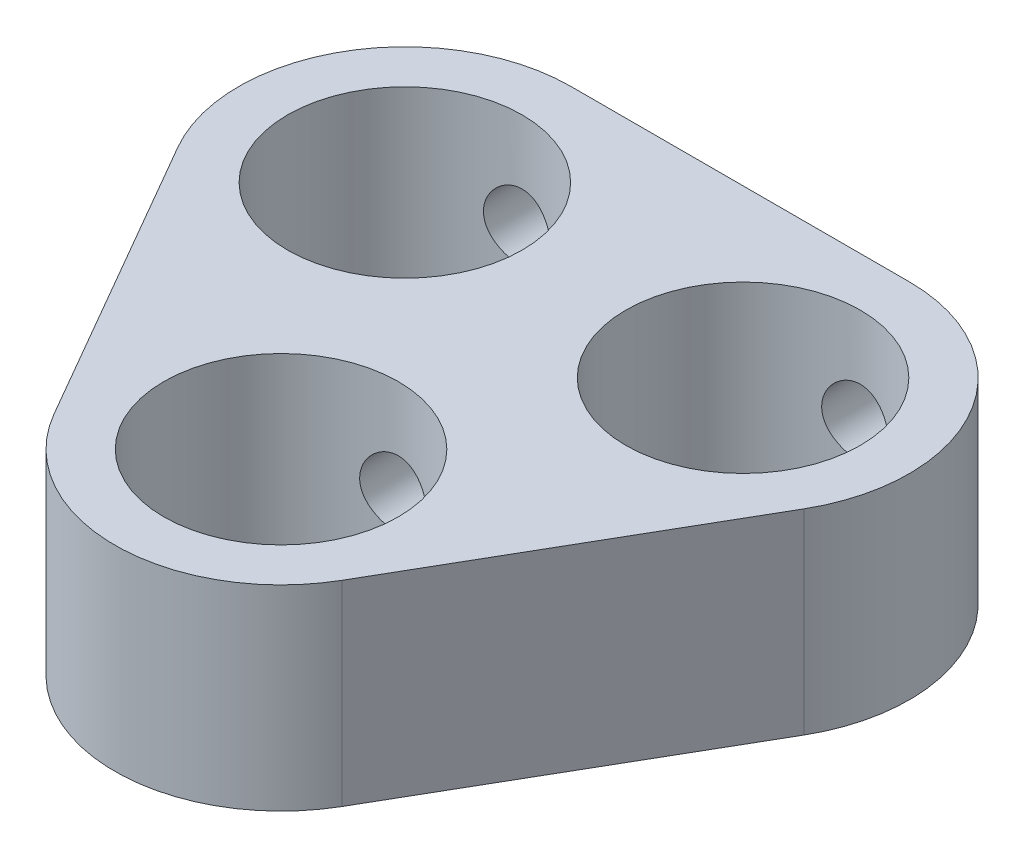
ISO-10303-21;
HEADER;
FILE_DESCRIPTION(('STEP AP214'),'2;1');
FILE_NAME('part.step','',(''),(''),'','','');
FILE_SCHEMA(('AUTOMOTIVE_DESIGN { 1 0 10303 214 1 1 1 1 }'));
ENDSEC;
DATA;
#1=APPLICATION_CONTEXT('core data for automotive mechanical design processes');
#2=APPLICATION_PROTOCOL_DEFINITION('international standard','automotive_design',2000,#1);
#3=PRODUCT_CONTEXT('',#1,'mechanical');
#4=PRODUCT('Part','Part','',(#3));
#5=PRODUCT_RELATED_PRODUCT_CATEGORY('part','',(#4));
#6=PRODUCT_DEFINITION_FORMATION('','',#4);
#7=PRODUCT_DEFINITION_CONTEXT('part definition',#1,'design');
#8=PRODUCT_DEFINITION('design','',#6,#7);
#9=PRODUCT_DEFINITION_SHAPE('','',#8);
#10=(LENGTH_UNIT() NAMED_UNIT(*) SI_UNIT(.MILLI.,.METRE.));
#11=(NAMED_UNIT(*) PLANE_ANGLE_UNIT() SI_UNIT($,.RADIAN.));
#12=(NAMED_UNIT(*) SI_UNIT($,.STERADIAN.) SOLID_ANGLE_UNIT());
#13=UNCERTAINTY_MEASURE_WITH_UNIT(LENGTH_MEASURE(1.E-05),#10,'distance_accuracy_value','');
#14=(GEOMETRIC_REPRESENTATION_CONTEXT(3) GLOBAL_UNCERTAINTY_ASSIGNED_CONTEXT((#13)) GLOBAL_UNIT_ASSIGNED_CONTEXT((#10,
#11,#12)) REPRESENTATION_CONTEXT('',''));
#15=CARTESIAN_POINT('',(0.,0.,0.));
#16=DIRECTION('',(0.,0.,1.));
#17=DIRECTION('',(1.,0.,0.));
#18=AXIS2_PLACEMENT_3D('',#15,#16,#17);
#19=CARTESIAN_POINT('',(-30.0082558139535,6.35,24.6044702842377));
#20=DIRECTION('',(0.,1.,0.));
#21=DIRECTION('',(0.,0.,1.));
#22=AXIS2_PLACEMENT_3D('',#19,#20,#21);
#23=PLANE('',#22);
#24=CARTESIAN_POINT('',(0.,6.35,6.32891365085668));
#25=DIRECTION('',(0.,-1.,0.));
#26=DIRECTION('',(0.,0.,-1.));
#27=AXIS2_PLACEMENT_3D('',#24,#25,#26);
#28=CIRCLE('',#27,3.8);
#29=CARTESIAN_POINT('',(0.,6.35,2.52891365085668));
#30=VERTEX_POINT('',#29);
#31=EDGE_CURVE('E45',#30,#30,#28,.T.);
#32=ORIENTED_EDGE('',*,*,#31,.T.);
#33=EDGE_LOOP('',(#32));
#34=FACE_BOUND('',#33,.T.);
#35=CARTESIAN_POINT('',(5.481,6.35,-3.16445682542834));
#36=DIRECTION('',(0.,-1.,0.));
#37=DIRECTION('',(0.,0.,-1.));
#38=AXIS2_PLACEMENT_3D('',#35,#36,#37);
#39=CIRCLE('',#38,3.8);
#40=CARTESIAN_POINT('',(5.481,6.35,-6.96445682542834));
#41=VERTEX_POINT('',#40);
#42=EDGE_CURVE('E135',#41,#41,#39,.T.);
#43=ORIENTED_EDGE('',*,*,#42,.T.);
#44=EDGE_LOOP('',(#43));
#45=FACE_BOUND('',#44,.T.);
#46=CARTESIAN_POINT('',(-5.481,6.35,-3.16445682542834));
#47=DIRECTION('',(0.,-1.,0.));
#48=DIRECTION('',(0.,0.,-1.));
#49=AXIS2_PLACEMENT_3D('',#46,#47,#48);
#50=CIRCLE('',#49,3.8);
#51=CARTESIAN_POINT('',(-5.481,6.35,-6.96445682542834));
#52=VERTEX_POINT('',#51);
#53=EDGE_CURVE('E128',#52,#52,#50,.T.);
#54=ORIENTED_EDGE('',*,*,#53,.T.);
#55=EDGE_LOOP('',(#54));
#56=FACE_BOUND('',#55,.T.);
#57=DIRECTION('',(1.,0.,0.));
#58=VECTOR('',#57,1.);
#59=CARTESIAN_POINT('',(5.481,6.35,-8.55195682542834));
#60=LINE('',#59,#58);
#61=CARTESIAN_POINT('',(-5.481,6.35,-8.55195682542834));
#62=VERTEX_POINT('',#61);
#63=CARTESIAN_POINT('',(5.481,6.35,-8.55195682542833));
#64=VERTEX_POINT('',#63);
#65=EDGE_CURVE('E219',#62,#64,#60,.T.);
#66=ORIENTED_EDGE('',*,*,#65,.F.);
#67=CARTESIAN_POINT('',(-5.481,6.35,-3.16445682542834));
#68=DIRECTION('',(0.,-1.,0.));
#69=DIRECTION('',(0.,0.,1.));
#70=AXIS2_PLACEMENT_3D('',#67,#68,#69);
#71=CIRCLE('',#70,5.3875);
#72=CARTESIAN_POINT('',(-10.1467118628887,6.35,-0.470706825428339));
#73=VERTEX_POINT('',#72);
#74=EDGE_CURVE('E217',#73,#62,#71,.T.);
#75=ORIENTED_EDGE('',*,*,#74,.F.);
#76=DIRECTION('',(-0.5,0.,-0.866025403784439));
#77=VECTOR('',#76,1.);
#78=CARTESIAN_POINT('',(-10.1467118628887,6.35,-0.470706825428339));
#79=LINE('',#78,#77);
#80=CARTESIAN_POINT('',(-4.66571186288866,6.35,9.02266365085668));
#81=VERTEX_POINT('',#80);
#82=EDGE_CURVE('E230',#81,#73,#79,.T.);
#83=ORIENTED_EDGE('',*,*,#82,.F.);
#84=CARTESIAN_POINT('',(0.,6.35,6.32891365085668));
#85=DIRECTION('',(0.,-1.,0.));
#86=DIRECTION('',(0.,0.,1.));
#87=AXIS2_PLACEMENT_3D('',#84,#85,#86);
#88=CIRCLE('',#87,5.3875);
#89=CARTESIAN_POINT('',(4.66571186288866,6.35,9.02266365085668));
#90=VERTEX_POINT('',#89);
#91=EDGE_CURVE('E227',#90,#81,#88,.T.);
#92=ORIENTED_EDGE('',*,*,#91,.F.);
#93=DIRECTION('',(-0.5,0.,0.866025403784439));
#94=VECTOR('',#93,1.);
#95=CARTESIAN_POINT('',(4.66571186288866,6.35,9.02266365085668));
#96=LINE('',#95,#94);
#97=CARTESIAN_POINT('',(10.1467118628887,6.35,-0.470706825428337));
#98=VERTEX_POINT('',#97);
#99=EDGE_CURVE('E224',#98,#90,#96,.T.);
#100=ORIENTED_EDGE('',*,*,#99,.F.);
#101=CARTESIAN_POINT('',(5.481,6.35,-3.16445682542834));
#102=DIRECTION('',(0.,-1.,0.));
#103=DIRECTION('',(0.,0.,-1.));
#104=AXIS2_PLACEMENT_3D('',#101,#102,#103);
#105=CIRCLE('',#104,5.3875);
#106=EDGE_CURVE('E221',#64,#98,#105,.T.);
#107=ORIENTED_EDGE('',*,*,#106,.F.);
#108=EDGE_LOOP('',(#66,#75,#83,#92,#100,#107));
#109=FACE_BOUND('',#108,.T.);
#110=ADVANCED_FACE('F33',(#34,#45,#56,#109),#23,.T.);
#111=CARTESIAN_POINT('',(-30.0082558139535,0.,24.6044702842377));
#112=DIRECTION('',(0.,1.,0.));
#113=DIRECTION('',(0.,0.,1.));
#114=AXIS2_PLACEMENT_3D('',#111,#112,#113);
#115=PLANE('',#114);
#116=CARTESIAN_POINT('',(0.,0.,6.32891365085668));
#117=DIRECTION('',(0.,-1.,0.));
#118=DIRECTION('',(0.,0.,-1.));
#119=AXIS2_PLACEMENT_3D('',#116,#117,#118);
#120=CIRCLE('',#119,3.8);
#121=CARTESIAN_POINT('',(0.,0.,2.52891365085668));
#122=VERTEX_POINT('',#121);
#123=EDGE_CURVE('E138',#122,#122,#120,.T.);
#124=ORIENTED_EDGE('',*,*,#123,.F.);
#125=EDGE_LOOP('',(#124));
#126=FACE_BOUND('',#125,.T.);
#127=CARTESIAN_POINT('',(5.481,0.,-3.16445682542834));
#128=DIRECTION('',(0.,-1.,0.));
#129=DIRECTION('',(0.,0.,-1.));
#130=AXIS2_PLACEMENT_3D('',#127,#128,#129);
#131=CIRCLE('',#130,3.8);
#132=CARTESIAN_POINT('',(5.481,0.,-6.96445682542834));
#133=VERTEX_POINT('',#132);
#134=EDGE_CURVE('E132',#133,#133,#131,.T.);
#135=ORIENTED_EDGE('',*,*,#134,.F.);
#136=EDGE_LOOP('',(#135));
#137=FACE_BOUND('',#136,.T.);
#138=CARTESIAN_POINT('',(-5.481,0.,-3.16445682542834));
#139=DIRECTION('',(0.,-1.,0.));
#140=DIRECTION('',(0.,0.,-1.));
#141=AXIS2_PLACEMENT_3D('',#138,#139,#140);
#142=CIRCLE('',#141,3.8);
#143=CARTESIAN_POINT('',(-5.481,0.,-6.96445682542834));
#144=VERTEX_POINT('',#143);
#145=EDGE_CURVE('E125',#144,#144,#142,.T.);
#146=ORIENTED_EDGE('',*,*,#145,.F.);
#147=EDGE_LOOP('',(#146));
#148=FACE_BOUND('',#147,.T.);
#149=CARTESIAN_POINT('',(-5.481,0.,-3.16445682542834));
#150=DIRECTION('',(0.,-1.,0.));
#151=DIRECTION('',(0.,0.,1.));
#152=AXIS2_PLACEMENT_3D('',#149,#150,#151);
#153=CIRCLE('',#152,5.3875);
#154=CARTESIAN_POINT('',(-10.1467118628887,0.,-0.470706825428339));
#155=VERTEX_POINT('',#154);
#156=CARTESIAN_POINT('',(-5.481,0.,-8.55195682542834));
#157=VERTEX_POINT('',#156);
#158=EDGE_CURVE('E196',#155,#157,#153,.T.);
#159=ORIENTED_EDGE('',*,*,#158,.T.);
#160=DIRECTION('',(1.,0.,0.));
#161=VECTOR('',#160,1.);
#162=CARTESIAN_POINT('',(5.481,0.,-8.55195682542834));
#163=LINE('',#162,#161);
#164=CARTESIAN_POINT('',(5.481,0.,-8.55195682542834));
#165=VERTEX_POINT('',#164);
#166=EDGE_CURVE('E197',#157,#165,#163,.T.);
#167=ORIENTED_EDGE('',*,*,#166,.T.);
#168=CARTESIAN_POINT('',(5.481,0.,-3.16445682542834));
#169=DIRECTION('',(0.,-1.,0.));
#170=DIRECTION('',(0.,0.,-1.));
#171=AXIS2_PLACEMENT_3D('',#168,#169,#170);
#172=CIRCLE('',#171,5.3875);
#173=CARTESIAN_POINT('',(10.1467118628887,0.,-0.470706825428337));
#174=VERTEX_POINT('',#173);
#175=EDGE_CURVE('E114',#165,#174,#172,.T.);
#176=ORIENTED_EDGE('',*,*,#175,.T.);
#177=DIRECTION('',(-0.5,0.,0.866025403784439));
#178=VECTOR('',#177,1.);
#179=CARTESIAN_POINT('',(4.66571186288866,0.,9.02266365085668));
#180=LINE('',#179,#178);
#181=CARTESIAN_POINT('',(4.66571186288866,0.,9.02266365085668));
#182=VERTEX_POINT('',#181);
#183=EDGE_CURVE('E211',#174,#182,#180,.T.);
#184=ORIENTED_EDGE('',*,*,#183,.T.);
#185=CARTESIAN_POINT('',(0.,0.,6.32891365085668));
#186=DIRECTION('',(0.,-1.,0.));
#187=DIRECTION('',(0.,0.,1.));
#188=AXIS2_PLACEMENT_3D('',#185,#186,#187);
#189=CIRCLE('',#188,5.3875);
#190=CARTESIAN_POINT('',(-4.66571186288866,0.,9.02266365085668));
#191=VERTEX_POINT('',#190);
#192=EDGE_CURVE('E214',#182,#191,#189,.T.);
#193=ORIENTED_EDGE('',*,*,#192,.T.);
#194=DIRECTION('',(-0.5,0.,-0.866025403784439));
#195=VECTOR('',#194,1.);
#196=CARTESIAN_POINT('',(-10.1467118628887,0.,-0.470706825428339));
#197=LINE('',#196,#195);
#198=EDGE_CURVE('E200',#191,#155,#197,.T.);
#199=ORIENTED_EDGE('',*,*,#198,.T.);
#200=EDGE_LOOP('',(#159,#167,#176,#184,#193,#199));
#201=FACE_BOUND('',#200,.T.);
#202=ADVANCED_FACE('F179',(#126,#137,#148,#201),#115,.F.);
#203=CARTESIAN_POINT('',(0.,6.35,6.32891365085668));
#204=DIRECTION('',(0.,-1.,0.));
#205=DIRECTION('',(0.,0.,-1.));
#206=AXIS2_PLACEMENT_3D('',#203,#204,#205);
#207=CYLINDRICAL_SURFACE('',#206,3.8);
#208=CARTESIAN_POINT('',(0.,4.2672,2.52891365085668));
#209=CARTESIAN_POINT('',(0.060031218785892,4.26719897791606,2.52891434347022));
#210=CARTESIAN_POINT('',(0.120072915420923,4.26223421465089,2.53034994075673));
#211=CARTESIAN_POINT('',(0.238415122195879,4.24254876485753,2.5359369157727));
#212=CARTESIAN_POINT('',(0.296714981583735,4.22782447863865,2.54008929554964));
#213=CARTESIAN_POINT('',(0.409849037617068,4.18914689329083,2.55065354210716));
#214=CARTESIAN_POINT('',(0.464687974190028,4.16520655000439,2.55706223590796));
#215=CARTESIAN_POINT('',(0.569573097372234,4.10882759631651,2.57146868188497));
#216=CARTESIAN_POINT('',(0.619618765420974,4.07638806784432,2.57946660570515));
#217=CARTESIAN_POINT('',(0.714826705146357,4.00302242655112,2.59643201975026));
#218=CARTESIAN_POINT('',(0.759843527421824,3.96191187152417,2.60541812619179));
#219=CARTESIAN_POINT('',(0.842448225007434,3.87276469269223,2.62323283210277));
#220=CARTESIAN_POINT('',(0.880034970972817,3.82472701790622,2.63206140744282));
#221=CARTESIAN_POINT('',(0.947455801108832,3.72188583625349,2.64875578694304));
#222=CARTESIAN_POINT('',(0.977116354781186,3.66696443543915,2.65659831435072));
#223=CARTESIAN_POINT('',(1.0267226882237,3.55265183089571,2.67015613995768));
#224=CARTESIAN_POINT('',(1.04667058605939,3.49326160496003,2.6758719018824));
#225=CARTESIAN_POINT('',(1.07576839878067,3.37332212831441,2.68433573352427));
#226=CARTESIAN_POINT('',(1.085184778726,3.31284281337282,2.6871568811307));
#227=CARTESIAN_POINT('',(1.09378385738042,3.19110212361764,2.68972984201336));
#228=CARTESIAN_POINT('',(1.0929688092589,3.12984092395954,2.68948233107101));
#229=CARTESIAN_POINT('',(1.08133833508953,3.01040756010223,2.6860109570606));
#230=CARTESIAN_POINT('',(1.07085218172353,2.95220001833402,2.68288509875311));
#231=CARTESIAN_POINT('',(1.04070734969126,2.83840771727075,2.67416715145163));
#232=CARTESIAN_POINT('',(1.02104783290423,2.78282319813818,2.6685748371134));
#233=CARTESIAN_POINT('',(0.972861900459607,2.67502887856568,2.65547281230094));
#234=CARTESIAN_POINT('',(0.944225355627805,2.62287129769538,2.64793950639801));
#235=CARTESIAN_POINT('',(0.87897488912003,2.52398938024265,2.63181617279598));
#236=CARTESIAN_POINT('',(0.842359172816134,2.4772662695808,2.62322590756139));
#237=CARTESIAN_POINT('',(0.760535551956272,2.38870647524914,2.60555497688137));
#238=CARTESIAN_POINT('',(0.715053082682736,2.34712430403682,2.59646810695805));
#239=CARTESIAN_POINT('',(0.617647754909674,2.27212099425449,2.57911965852902));
#240=CARTESIAN_POINT('',(0.565724554858385,2.23870028876602,2.57085812383278));
#241=CARTESIAN_POINT('',(0.456475938551637,2.18083095454478,2.55602592997764));
#242=CARTESIAN_POINT('',(0.399121335776737,2.15643470977249,2.54946520724517));
#243=CARTESIAN_POINT('',(0.280891753596605,2.11770750138978,2.53884545191302));
#244=CARTESIAN_POINT('',(0.22001767684282,2.10337396924714,2.53478578094613));
#245=CARTESIAN_POINT('',(0.0986440445732786,2.08559333605812,2.52972479765479));
#246=CARTESIAN_POINT('',(0.0381990475564544,2.08180088971235,2.52862650262033));
#247=CARTESIAN_POINT('',(-0.0824656434810664,2.08424768484174,2.52932971671326));
#248=CARTESIAN_POINT('',(-0.14268536399668,2.0904857069081,2.53113087335296));
#249=CARTESIAN_POINT('',(-0.259914284207444,2.11253540676782,2.53736741724113));
#250=CARTESIAN_POINT('',(-0.316963941906179,2.12814886666812,2.54174822864645));
#251=CARTESIAN_POINT('',(-0.427624535983613,2.16827100125244,2.55264149484041));
#252=CARTESIAN_POINT('',(-0.481235071815966,2.19278070985606,2.55915419738822));
#253=CARTESIAN_POINT('',(-0.584794230812888,2.2506027736067,2.57380879243655));
#254=CARTESIAN_POINT('',(-0.634637375017193,2.28409559932899,2.5819831445978));
#255=CARTESIAN_POINT('',(-0.728115015099675,2.35871100683437,2.59901956873822));
#256=CARTESIAN_POINT('',(-0.771748077503383,2.39983534517033,2.60788179877319));
#257=CARTESIAN_POINT('',(-0.853062798047444,2.49016573776508,2.62566158783617));
#258=CARTESIAN_POINT('',(-0.890499396883015,2.53959439997367,2.63457125289181));
#259=CARTESIAN_POINT('',(-0.956559226719259,2.6442247388266,2.65112104993079));
#260=CARTESIAN_POINT('',(-0.98518275678838,2.69942621948716,2.65876122498979));
#261=CARTESIAN_POINT('',(-1.03259641712685,2.81381175546774,2.67181780876474));
#262=CARTESIAN_POINT('',(-1.05143803542899,2.87297306860858,2.6772458281884));
#263=CARTESIAN_POINT('',(-1.07884499059942,2.99381104730829,2.6852477424678));
#264=CARTESIAN_POINT('',(-1.08741348804699,3.05548693320452,2.68782251512134));
#265=CARTESIAN_POINT('',(-1.09382849457239,3.1770724181761,2.68974493447742));
#266=CARTESIAN_POINT('',(-1.09207217975732,3.23695946032525,2.68921213017475));
#267=CARTESIAN_POINT('',(-1.07882505600226,3.35554528560126,2.68526393678948));
#268=CARTESIAN_POINT('',(-1.06733457921172,3.41424410920258,2.68184864606321));
#269=CARTESIAN_POINT('',(-1.03519195591513,3.52819650802038,2.6725970912211));
#270=CARTESIAN_POINT('',(-1.01463677747975,3.58347966984948,2.66678649229887));
#271=CARTESIAN_POINT('',(-0.965023278285514,3.68985636007174,2.6534018113877));
#272=CARTESIAN_POINT('',(-0.935963437699719,3.7409491375305,2.6458274142484));
#273=CARTESIAN_POINT('',(-0.869015810349296,3.83935861582784,2.6294494475058));
#274=CARTESIAN_POINT('',(-0.83086320954295,3.88648970584979,2.62061302398861));
#275=CARTESIAN_POINT('',(-0.747300190894413,3.9738094837209,2.60287501455081));
#276=CARTESIAN_POINT('',(-0.70188794155044,4.0139964143234,2.59397341272888));
#277=CARTESIAN_POINT('',(-0.603667868535475,4.08732589591425,2.57683008188693));
#278=CARTESIAN_POINT('',(-0.55069813418863,4.12025753751271,2.56861159947749));
#279=CARTESIAN_POINT('',(-0.439737764368531,4.1766990863314,2.55402912576196));
#280=CARTESIAN_POINT('',(-0.381749847497405,4.20021405665699,2.54766413838222));
#281=CARTESIAN_POINT('',(-0.270123569139865,4.23466690360035,2.53816741764184));
#282=CARTESIAN_POINT('',(-0.216888692787154,4.24683566771849,2.53472457413798));
#283=CARTESIAN_POINT('',(-0.109105307920217,4.2631021257725,2.53009753121572));
#284=CARTESIAN_POINT('',(-0.0545569809759335,4.26720092888025,2.52891302140246));
#285=CARTESIAN_POINT('',(0.,4.2672,2.52891365085668));
#286=B_SPLINE_CURVE_WITH_KNOTS('',3,(#208,#209,#210,#211,#212,#213,#214,#215,#216,#217,#218,
#219,#220,#221,#222,#223,#224,#225,#226,#227,#228,#229,#230,#231,#232,#233,#234,#235,#236,#237,
#238,#239,#240,#241,#242,#243,#244,#245,#246,#247,#248,#249,#250,#251,#252,#253,#254,#255,#256,
#257,#258,#259,#260,#261,#262,#263,#264,#265,#266,#267,#268,#269,#270,#271,#272,#273,#274,#275,
#276,#277,#278,#279,#280,#281,#282,#283,#284,#285),.UNSPECIFIED.,.T.,.F.,(4,2,2,2,2,2,2,2,2,2,2,
2,2,2,2,2,2,2,2,2,2,2,2,2,2,2,2,2,2,2,2,2,2,2,2,2,2,2,4),(0.,0.179893384726956,
0.359853158063641,0.539560864159937,0.719287990054177,0.903314290305684,1.08736854041895,
1.27517222638532,1.46293493912293,1.64583116416468,1.82868711242978,2.00553841201756,
2.18240587271992,2.36153414709249,2.54070275159295,2.72670861832788,2.91272435316874,
3.0998035056097,3.28683488825618,3.4676621983674,3.64846752687866,3.82557855274192,
4.00271016899437,4.18370831360819,4.36474817053498,4.55178583221417,4.73881714613513,
4.92485375847347,5.11083312097783,5.28970623101571,5.4685732377842,5.64557158214663,
5.82260157635943,6.00560560668286,6.18865587928657,6.37647726247969,6.56419752284781,
6.72770893220019,6.89119786623714),.UNSPECIFIED.);
#287=CARTESIAN_POINT('',(0.,4.2672,2.52891365085668));
#288=VERTEX_POINT('',#287);
#289=EDGE_CURVE('E36',#288,#288,#286,.T.);
#290=ORIENTED_EDGE('',*,*,#289,.T.);
#291=EDGE_LOOP('',(#290));
#292=FACE_BOUND('',#291,.T.);
#293=ORIENTED_EDGE('',*,*,#31,.F.);
#294=EDGE_LOOP('',(#293));
#295=FACE_BOUND('',#294,.T.);
#296=ORIENTED_EDGE('',*,*,#123,.T.);
#297=EDGE_LOOP('',(#296));
#298=FACE_BOUND('',#297,.T.);
#299=ADVANCED_FACE('F173',(#292,#295,#298),#207,.F.);
#300=CARTESIAN_POINT('',(5.481,6.35,-3.16445682542834));
#301=DIRECTION('',(0.,-1.,0.));
#302=DIRECTION('',(0.,0.,-1.));
#303=AXIS2_PLACEMENT_3D('',#300,#301,#302);
#304=CYLINDRICAL_SURFACE('',#303,3.8);
#305=CARTESIAN_POINT('',(5.481,4.2672,-6.96445682542834));
#306=CARTESIAN_POINT('',(5.54103121878589,4.26719897791607,-6.96445613281479));
#307=CARTESIAN_POINT('',(5.60107291542092,4.26223421465089,-6.96302053552828));
#308=CARTESIAN_POINT('',(5.71941512219588,4.24254876485753,-6.95743356051231));
#309=CARTESIAN_POINT('',(5.77771498158373,4.22782447863865,-6.95328118073537));
#310=CARTESIAN_POINT('',(5.89084903761707,4.18914689329083,-6.94271693417785));
#311=CARTESIAN_POINT('',(5.94568797419003,4.16520655000439,-6.93630824037706));
#312=CARTESIAN_POINT('',(6.05057309737224,4.10882759631651,-6.92190179440005));
#313=CARTESIAN_POINT('',(6.10061876542098,4.07638806784433,-6.91390387057986));
#314=CARTESIAN_POINT('',(6.19582670514636,4.00302242655112,-6.89693845653476));
#315=CARTESIAN_POINT('',(6.24084352742183,3.96191187152417,-6.88795235009323));
#316=CARTESIAN_POINT('',(6.32344822500743,3.87276469269223,-6.87013764418224));
#317=CARTESIAN_POINT('',(6.36103497097282,3.82472701790622,-6.86130906884219));
#318=CARTESIAN_POINT('',(6.42845580110883,3.72188583625349,-6.84461468934197));
#319=CARTESIAN_POINT('',(6.45811635478119,3.66696443543915,-6.8367721619343));
#320=CARTESIAN_POINT('',(6.5077226882237,3.55265183089571,-6.82321433632733));
#321=CARTESIAN_POINT('',(6.52767058605939,3.49326160496003,-6.81749857440262));
#322=CARTESIAN_POINT('',(6.55676839878067,3.37332212831441,-6.80903474276074));
#323=CARTESIAN_POINT('',(6.566184778726,3.31284281337282,-6.80621359515431));
#324=CARTESIAN_POINT('',(6.57478385738042,3.19110212361764,-6.80364063427165));
#325=CARTESIAN_POINT('',(6.5739688092589,3.12984092395954,-6.80388814521401));
#326=CARTESIAN_POINT('',(6.56233833508953,3.01040756010222,-6.80735951922442));
#327=CARTESIAN_POINT('',(6.55185218172353,2.95220001833402,-6.8104853775319));
#328=CARTESIAN_POINT('',(6.52170734969126,2.83840771727074,-6.81920332483338));
#329=CARTESIAN_POINT('',(6.50204783290423,2.78282319813818,-6.82479563917161));
#330=CARTESIAN_POINT('',(6.4538619004596,2.67502887856568,-6.83789766398408));
#331=CARTESIAN_POINT('',(6.4252253556278,2.62287129769537,-6.845430969887));
#332=CARTESIAN_POINT('',(6.35997488912003,2.52398938024264,-6.86155430348903));
#333=CARTESIAN_POINT('',(6.32335917281613,2.4772662695808,-6.87014456872362));
#334=CARTESIAN_POINT('',(6.24153555195627,2.38870647524914,-6.88781549940365));
#335=CARTESIAN_POINT('',(6.19605308268273,2.34712430403681,-6.89690236932696));
#336=CARTESIAN_POINT('',(6.09864775490967,2.27212099425449,-6.914250817756));
#337=CARTESIAN_POINT('',(6.04672455485838,2.23870028876601,-6.92251235245223));
#338=CARTESIAN_POINT('',(5.93747593855163,2.18083095454478,-6.93734454630738));
#339=CARTESIAN_POINT('',(5.88012133577673,2.15643470977248,-6.94390526903985));
#340=CARTESIAN_POINT('',(5.7618917535966,2.11770750138977,-6.95452502437199));
#341=CARTESIAN_POINT('',(5.70101767684281,2.10337396924714,-6.95858469533889));
#342=CARTESIAN_POINT('',(5.57964404457327,2.08559333605811,-6.96364567863022));
#343=CARTESIAN_POINT('',(5.51919904755645,2.08180088971234,-6.96474397366468));
#344=CARTESIAN_POINT('',(5.39853435651893,2.08424768484173,-6.96404075957175));
#345=CARTESIAN_POINT('',(5.33831463600331,2.09048570690809,-6.96223960293205));
#346=CARTESIAN_POINT('',(5.22108571579255,2.11253540676782,-6.95600305904388));
#347=CARTESIAN_POINT('',(5.16403605809381,2.12814886666811,-6.95162224763856));
#348=CARTESIAN_POINT('',(5.05337546401638,2.16827100125244,-6.9407289814446));
#349=CARTESIAN_POINT('',(4.99976492818403,2.19278070985606,-6.9342162788968));
#350=CARTESIAN_POINT('',(4.8962057691871,2.2506027736067,-6.91956168384847));
#351=CARTESIAN_POINT('',(4.8463626249828,2.28409559932899,-6.91138733168722));
#352=CARTESIAN_POINT('',(4.75288498490032,2.35871100683437,-6.89435090754679));
#353=CARTESIAN_POINT('',(4.70925192249661,2.39983534517033,-6.88548867751183));
#354=CARTESIAN_POINT('',(4.62793720195255,2.49016573776508,-6.86770888844884));
#355=CARTESIAN_POINT('',(4.59050060311698,2.53959439997367,-6.8587992233932));
#356=CARTESIAN_POINT('',(4.52444077328073,2.6442247388266,-6.84224942635422));
#357=CARTESIAN_POINT('',(4.49581724321161,2.69942621948716,-6.83460925129522));
#358=CARTESIAN_POINT('',(4.44840358287314,2.81381175546774,-6.82155266752027));
#359=CARTESIAN_POINT('',(4.429561964571,2.87297306860858,-6.81612464809661));
#360=CARTESIAN_POINT('',(4.40215500940057,2.99381104730829,-6.80812273381721));
#361=CARTESIAN_POINT('',(4.393586511953,3.05548693320453,-6.80554796116367));
#362=CARTESIAN_POINT('',(4.3871715054276,3.1770724181761,-6.80362554180759));
#363=CARTESIAN_POINT('',(4.38892782024267,3.23695946032526,-6.80415834611027));
#364=CARTESIAN_POINT('',(4.40217494399774,3.35554528560127,-6.80810653949553));
#365=CARTESIAN_POINT('',(4.41366542078827,3.41424410920258,-6.8115218302218));
#366=CARTESIAN_POINT('',(4.44580804408487,3.52819650802039,-6.82077338506391));
#367=CARTESIAN_POINT('',(4.46636322252024,3.58347966984949,-6.82658398398614));
#368=CARTESIAN_POINT('',(4.51597672171448,3.68985636007174,-6.83996866489731));
#369=CARTESIAN_POINT('',(4.54503656230027,3.74094913753051,-6.84754306203661));
#370=CARTESIAN_POINT('',(4.6119841896507,3.83935861582785,-6.86392102877921));
#371=CARTESIAN_POINT('',(4.65013679045704,3.88648970584979,-6.87275745229641));
#372=CARTESIAN_POINT('',(4.73369980910558,3.9738094837209,-6.8904954617342));
#373=CARTESIAN_POINT('',(4.77911205844956,4.01399641432341,-6.89939706355613));
#374=CARTESIAN_POINT('',(4.87733213146452,4.08732589591426,-6.91654039439808));
#375=CARTESIAN_POINT('',(4.93030186581137,4.12025753751272,-6.92475887680752));
#376=CARTESIAN_POINT('',(5.04126223563147,4.1766990863314,-6.93934135052306));
#377=CARTESIAN_POINT('',(5.09925015250259,4.20021405665699,-6.94570633790279));
#378=CARTESIAN_POINT('',(5.21087643086013,4.23466690360036,-6.95520305864317));
#379=CARTESIAN_POINT('',(5.26411130721285,4.24683566771849,-6.95864590214704));
#380=CARTESIAN_POINT('',(5.37189469207978,4.26310212577251,-6.9632729450693));
#381=CARTESIAN_POINT('',(5.42644301902407,4.26720092888025,-6.96445745488256));
#382=CARTESIAN_POINT('',(5.481,4.2672,-6.96445682542834));
#383=B_SPLINE_CURVE_WITH_KNOTS('',3,(#305,#306,#307,#308,#309,#310,#311,#312,#313,#314,#315,
#316,#317,#318,#319,#320,#321,#322,#323,#324,#325,#326,#327,#328,#329,#330,#331,#332,#333,#334,
#335,#336,#337,#338,#339,#340,#341,#342,#343,#344,#345,#346,#347,#348,#349,#350,#351,#352,#353,
#354,#355,#356,#357,#358,#359,#360,#361,#362,#363,#364,#365,#366,#367,#368,#369,#370,#371,#372,
#373,#374,#375,#376,#377,#378,#379,#380,#381,#382),.UNSPECIFIED.,.T.,.F.,(4,2,2,2,2,2,2,2,2,2,2,
2,2,2,2,2,2,2,2,2,2,2,2,2,2,2,2,2,2,2,2,2,2,2,2,2,2,2,4),(0.,0.179893384726957,
0.359853158063641,0.539560864159939,0.719287990054179,0.903314290305686,1.08736854041895,
1.27517222638533,1.46293493912293,1.64583116416469,1.82868711242979,2.00553841201756,
2.18240587271993,2.3615341470925,2.54070275159296,2.72670861832788,2.91272435316875,
3.09980350560971,3.28683488825619,3.4676621983674,3.64846752687868,3.82557855274193,
4.00271016899438,4.1837083136082,4.364748170535,4.55178583221418,4.73881714613514,
4.92485375847349,5.11083312097785,5.28970623101572,5.46857323778422,5.64557158214665,
5.82260157635945,6.00560560668287,6.1886558792866,6.37647726247971,6.56419752284783,
6.72770893220021,6.89119786623717),.UNSPECIFIED.);
#384=CARTESIAN_POINT('',(5.481,4.2672,-6.96445682542834));
#385=VERTEX_POINT('',#384);
#386=EDGE_CURVE('E110',#385,#385,#383,.T.);
#387=ORIENTED_EDGE('',*,*,#386,.T.);
#388=EDGE_LOOP('',(#387));
#389=FACE_BOUND('',#388,.T.);
#390=ORIENTED_EDGE('',*,*,#42,.F.);
#391=EDGE_LOOP('',(#390));
#392=FACE_BOUND('',#391,.T.);
#393=ORIENTED_EDGE('',*,*,#134,.T.);
#394=EDGE_LOOP('',(#393));
#395=FACE_BOUND('',#394,.T.);
#396=ADVANCED_FACE('F168',(#389,#392,#395),#304,.F.);
#397=CARTESIAN_POINT('',(-5.481,6.35,-3.16445682542834));
#398=DIRECTION('',(0.,-1.,0.));
#399=DIRECTION('',(0.,0.,-1.));
#400=AXIS2_PLACEMENT_3D('',#397,#398,#399);
#401=CYLINDRICAL_SURFACE('',#400,3.8);
#402=CARTESIAN_POINT('',(-5.481,4.2672,-6.96445682542834));
#403=CARTESIAN_POINT('',(-5.42096878121411,4.26719897791607,-6.96445613281479));
#404=CARTESIAN_POINT('',(-5.36092708457908,4.26223421465089,-6.96302053552828));
#405=CARTESIAN_POINT('',(-5.24258487780412,4.24254876485753,-6.95743356051232));
#406=CARTESIAN_POINT('',(-5.18428501841626,4.22782447863865,-6.95328118073537));
#407=CARTESIAN_POINT('',(-5.07115096238293,4.18914689329084,-6.94271693417785));
#408=CARTESIAN_POINT('',(-5.01631202580997,4.16520655000439,-6.93630824037706));
#409=CARTESIAN_POINT('',(-4.91142690262776,4.10882759631651,-6.92190179440005));
#410=CARTESIAN_POINT('',(-4.86138123457902,4.07638806784433,-6.91390387057986));
#411=CARTESIAN_POINT('',(-4.76617329485364,4.00302242655113,-6.89693845653476));
#412=CARTESIAN_POINT('',(-4.72115647257817,3.96191187152417,-6.88795235009323));
#413=CARTESIAN_POINT('',(-4.63855177499256,3.87276469269223,-6.87013764418224));
#414=CARTESIAN_POINT('',(-4.60096502902718,3.82472701790622,-6.86130906884219));
#415=CARTESIAN_POINT('',(-4.53354419889116,3.72188583625349,-6.84461468934197));
#416=CARTESIAN_POINT('',(-4.50388364521881,3.66696443543915,-6.8367721619343));
#417=CARTESIAN_POINT('',(-4.4542773117763,3.55265183089571,-6.82321433632733));
#418=CARTESIAN_POINT('',(-4.43432941394061,3.49326160496003,-6.81749857440262));
#419=CARTESIAN_POINT('',(-4.40523160121932,3.37332212831441,-6.80903474276074));
#420=CARTESIAN_POINT('',(-4.395815221274,3.31284281337282,-6.80621359515431));
#421=CARTESIAN_POINT('',(-4.38721614261957,3.19110212361764,-6.80364063427165));
#422=CARTESIAN_POINT('',(-4.38803119074109,3.12984092395954,-6.80388814521401));
#423=CARTESIAN_POINT('',(-4.39966166491047,3.01040756010223,-6.80735951922442));
#424=CARTESIAN_POINT('',(-4.41014781827646,2.95220001833402,-6.8104853775319));
#425=CARTESIAN_POINT('',(-4.44029265030873,2.83840771727074,-6.81920332483338));
#426=CARTESIAN_POINT('',(-4.45995216709577,2.78282319813818,-6.82479563917161));
#427=CARTESIAN_POINT('',(-4.50813809954039,2.67502887856568,-6.83789766398408));
#428=CARTESIAN_POINT('',(-4.53677464437219,2.62287129769538,-6.845430969887));
#429=CARTESIAN_POINT('',(-4.60202511087997,2.52398938024265,-6.86155430348903));
#430=CARTESIAN_POINT('',(-4.63864082718386,2.4772662695808,-6.87014456872362));
#431=CARTESIAN_POINT('',(-4.72046444804373,2.38870647524914,-6.88781549940365));
#432=CARTESIAN_POINT('',(-4.76594691731726,2.34712430403682,-6.89690236932696));
#433=CARTESIAN_POINT('',(-4.86335224509032,2.27212099425449,-6.914250817756));
#434=CARTESIAN_POINT('',(-4.91527544514161,2.23870028876601,-6.92251235245223));
#435=CARTESIAN_POINT('',(-5.02452406144836,2.18083095454478,-6.93734454630738));
#436=CARTESIAN_POINT('',(-5.08187866422326,2.15643470977248,-6.94390526903985));
#437=CARTESIAN_POINT('',(-5.20010824640339,2.11770750138978,-6.95452502437199));
#438=CARTESIAN_POINT('',(-5.26098232315718,2.10337396924714,-6.95858469533889));
#439=CARTESIAN_POINT('',(-5.38235595542672,2.08559333605811,-6.96364567863022));
#440=CARTESIAN_POINT('',(-5.44280095244355,2.08180088971234,-6.96474397366468));
#441=CARTESIAN_POINT('',(-5.56346564348107,2.08424768484173,-6.96404075957175));
#442=CARTESIAN_POINT('',(-5.62368536399668,2.09048570690809,-6.96223960293205));
#443=CARTESIAN_POINT('',(-5.74091428420744,2.11253540676781,-6.95600305904388));
#444=CARTESIAN_POINT('',(-5.79796394190618,2.12814886666811,-6.95162224763856));
#445=CARTESIAN_POINT('',(-5.90862453598362,2.16827100125244,-6.9407289814446));
#446=CARTESIAN_POINT('',(-5.96223507181597,2.19278070985606,-6.9342162788968));
#447=CARTESIAN_POINT('',(-6.06579423081289,2.2506027736067,-6.91956168384847));
#448=CARTESIAN_POINT('',(-6.1156373750172,2.28409559932899,-6.91138733168722));
#449=CARTESIAN_POINT('',(-6.20911501509968,2.35871100683437,-6.89435090754679));
#450=CARTESIAN_POINT('',(-6.25274807750339,2.39983534517032,-6.88548867751183));
#451=CARTESIAN_POINT('',(-6.33406279804745,2.49016573776507,-6.86770888844884));
#452=CARTESIAN_POINT('',(-6.37149939688302,2.53959439997367,-6.85879922339321));
#453=CARTESIAN_POINT('',(-6.43755922671926,2.6442247388266,-6.84224942635422));
#454=CARTESIAN_POINT('',(-6.46618275678838,2.69942621948716,-6.83460925129522));
#455=CARTESIAN_POINT('',(-6.51359641712686,2.81381175546774,-6.82155266752028));
#456=CARTESIAN_POINT('',(-6.53243803542899,2.87297306860858,-6.81612464809661));
#457=CARTESIAN_POINT('',(-6.55984499059943,2.99381104730829,-6.80812273381721));
#458=CARTESIAN_POINT('',(-6.56841348804699,3.05548693320452,-6.80554796116367));
#459=CARTESIAN_POINT('',(-6.5748284945724,3.1770724181761,-6.80362554180759));
#460=CARTESIAN_POINT('',(-6.57307217975732,3.23695946032525,-6.80415834611027));
#461=CARTESIAN_POINT('',(-6.55982505600226,3.35554528560126,-6.80810653949553));
#462=CARTESIAN_POINT('',(-6.54833457921172,3.41424410920258,-6.8115218302218));
#463=CARTESIAN_POINT('',(-6.51619195591513,3.52819650802038,-6.82077338506392));
#464=CARTESIAN_POINT('',(-6.49563677747975,3.58347966984948,-6.82658398398614));
#465=CARTESIAN_POINT('',(-6.44602327828552,3.68985636007174,-6.83996866489731));
#466=CARTESIAN_POINT('',(-6.41696343769972,3.74094913753051,-6.84754306203662));
#467=CARTESIAN_POINT('',(-6.3500158103493,3.83935861582785,-6.86392102877921));
#468=CARTESIAN_POINT('',(-6.31186320954295,3.88648970584979,-6.87275745229641));
#469=CARTESIAN_POINT('',(-6.22830019089441,3.9738094837209,-6.8904954617342));
#470=CARTESIAN_POINT('',(-6.18288794155044,4.01399641432341,-6.89939706355613));
#471=CARTESIAN_POINT('',(-6.08466786853548,4.08732589591426,-6.91654039439808));
#472=CARTESIAN_POINT('',(-6.03169813418863,4.12025753751272,-6.92475887680752));
#473=CARTESIAN_POINT('',(-5.92073776436853,4.1766990863314,-6.93934135052306));
#474=CARTESIAN_POINT('',(-5.86274984749741,4.20021405665699,-6.94570633790279));
#475=CARTESIAN_POINT('',(-5.75112356913987,4.23466690360036,-6.95520305864317));
#476=CARTESIAN_POINT('',(-5.69788869278715,4.24683566771849,-6.95864590214704));
#477=CARTESIAN_POINT('',(-5.59010530792022,4.26310212577251,-6.9632729450693));
#478=CARTESIAN_POINT('',(-5.53555698097593,4.26720092888025,-6.96445745488256));
#479=CARTESIAN_POINT('',(-5.481,4.2672,-6.96445682542834));
#480=B_SPLINE_CURVE_WITH_KNOTS('',3,(#402,#403,#404,#405,#406,#407,#408,#409,#410,#411,#412,
#413,#414,#415,#416,#417,#418,#419,#420,#421,#422,#423,#424,#425,#426,#427,#428,#429,#430,#431,
#432,#433,#434,#435,#436,#437,#438,#439,#440,#441,#442,#443,#444,#445,#446,#447,#448,#449,#450,
#451,#452,#453,#454,#455,#456,#457,#458,#459,#460,#461,#462,#463,#464,#465,#466,#467,#468,#469,
#470,#471,#472,#473,#474,#475,#476,#477,#478,#479),.UNSPECIFIED.,.T.,.F.,(4,2,2,2,2,2,2,2,2,2,2,
2,2,2,2,2,2,2,2,2,2,2,2,2,2,2,2,2,2,2,2,2,2,2,2,2,2,2,4),(0.,0.179893384726957,
0.359853158063642,0.539560864159939,0.719287990054179,0.903314290305687,1.08736854041895,
1.27517222638533,1.46293493912293,1.64583116416469,1.82868711242979,2.00553841201756,
2.18240587271993,2.3615341470925,2.54070275159296,2.72670861832789,2.91272435316875,
3.09980350560971,3.2868348882562,3.46766219836741,3.64846752687868,3.82557855274193,
4.00271016899439,4.1837083136082,4.364748170535,4.55178583221418,4.73881714613514,
4.92485375847349,5.11083312097785,5.28970623101572,5.46857323778422,5.64557158214665,
5.82260157635945,6.00560560668288,6.18865587928659,6.37647726247971,6.56419752284783,
6.72770893220021,6.89119786623716),.UNSPECIFIED.);
#481=CARTESIAN_POINT('',(-5.481,4.2672,-6.96445682542834));
#482=VERTEX_POINT('',#481);
#483=EDGE_CURVE('E202',#482,#482,#480,.T.);
#484=ORIENTED_EDGE('',*,*,#483,.T.);
#485=EDGE_LOOP('',(#484));
#486=FACE_BOUND('',#485,.T.);
#487=ORIENTED_EDGE('',*,*,#53,.F.);
#488=EDGE_LOOP('',(#487));
#489=FACE_BOUND('',#488,.T.);
#490=ORIENTED_EDGE('',*,*,#145,.T.);
#491=EDGE_LOOP('',(#490));
#492=FACE_BOUND('',#491,.T.);
#493=ADVANCED_FACE('F172',(#486,#489,#492),#401,.F.);
#494=CARTESIAN_POINT('',(-5.481,6.35,-3.16445682542834));
#495=DIRECTION('',(0.,-1.,0.));
#496=DIRECTION('',(0.,0.,-1.));
#497=AXIS2_PLACEMENT_3D('',#494,#495,#496);
#498=CYLINDRICAL_SURFACE('',#497,5.3875);
#499=CARTESIAN_POINT('',(-5.481,2.0828,-8.55195682542834));
#500=CARTESIAN_POINT('',(-5.51139726310363,2.08279984522627,-8.55195824817047));
#501=CARTESIAN_POINT('',(-5.54177966953494,2.08406979543031,-8.55169924580984));
#502=CARTESIAN_POINT('',(-5.60232116493755,2.08913378645766,-8.55067551495135));
#503=CARTESIAN_POINT('',(-5.63248028034151,2.09292752352975,-8.54991084731309));
#504=CARTESIAN_POINT('',(-5.72219972283491,2.10804649910711,-8.54688577376601));
#505=CARTESIAN_POINT('',(-5.78114970068784,2.1231096831374,-8.54389415370785));
#506=CARTESIAN_POINT('',(-5.89561929688577,2.16274191095387,-8.53628594732761));
#507=CARTESIAN_POINT('',(-5.95113848535511,2.18731214317744,-8.53166915785623));
#508=CARTESIAN_POINT('',(-6.05728080470596,2.24523902326858,-8.52131236327031));
#509=CARTESIAN_POINT('',(-6.10790346410918,2.27859651609709,-8.51557225015343));
#510=CARTESIAN_POINT('',(-6.20349516621447,2.35363537708021,-8.5035120632786));
#511=CARTESIAN_POINT('',(-6.24838680661546,2.39541430416276,-8.49718571145324));
#512=CARTESIAN_POINT('',(-6.33057975954261,2.48590517100742,-8.48471081394564));
#513=CARTESIAN_POINT('',(-6.36787980480801,2.5346182659837,-8.47856229809619));
#514=CARTESIAN_POINT('',(-6.43415853469147,2.63815508419895,-8.46707797094244));
#515=CARTESIAN_POINT('',(-6.46305614290023,2.69303168943194,-8.46175029705762));
#516=CARTESIAN_POINT('',(-6.51118901844663,2.80698432778718,-8.45260120101835));
#517=CARTESIAN_POINT('',(-6.53042579918868,2.86605970150058,-8.44877954296114));
#518=CARTESIAN_POINT('',(-6.55843929631602,2.98589520019612,-8.44313888149898));
#519=CARTESIAN_POINT('',(-6.56735308732929,3.0466220222574,-8.44129365919929));
#520=CARTESIAN_POINT('',(-6.57489346873248,3.16873654688773,-8.43973589168874));
#521=CARTESIAN_POINT('',(-6.57352090059376,3.23012419498794,-8.44002317202937));
#522=CARTESIAN_POINT('',(-6.56063789835205,3.35080953618275,-8.44267421857437));
#523=CARTESIAN_POINT('',(-6.54928516647888,3.41012487948985,-8.44500568197829));
#524=CARTESIAN_POINT('',(-6.51701324457643,3.52599077230246,-8.45143148212219));
#525=CARTESIAN_POINT('',(-6.49609365693011,3.58254120678486,-8.45552589213322));
#526=CARTESIAN_POINT('',(-6.44513174904669,3.69172625017852,-8.46504918536909));
#527=CARTESIAN_POINT('',(-6.41502704072856,3.74433091493952,-8.47048714476997));
#528=CARTESIAN_POINT('',(-6.34659432507027,3.84379924780053,-8.48207879438474));
#529=CARTESIAN_POINT('',(-6.30826560954356,3.89066242094231,-8.4882325462161));
#530=CARTESIAN_POINT('',(-6.22363553729197,3.97822367522594,-8.50070154816197));
#531=CARTESIAN_POINT('',(-6.17720057976502,4.01879259599374,-8.50701768760874));
#532=CARTESIAN_POINT('',(-6.07810234953859,4.0915968190827,-8.51899802550936));
#533=CARTESIAN_POINT('',(-6.02543740067585,4.1238298711936,-8.5246620477002));
#534=CARTESIAN_POINT('',(-5.91522119200884,4.179073287363,-8.53471535697188));
#535=CARTESIAN_POINT('',(-5.85765950927615,4.20206335043807,-8.53910183233662));
#536=CARTESIAN_POINT('',(-5.73941913629814,4.23797935345342,-8.54607976629767));
#537=CARTESIAN_POINT('',(-5.67874519182006,4.25092015774204,-8.54867387544109));
#538=CARTESIAN_POINT('',(-5.59482035824649,4.26149426091416,-8.55080259623021));
#539=CARTESIAN_POINT('',(-5.57209114355821,4.2636346535974,-8.55123499943823));
#540=CARTESIAN_POINT('',(-5.52657804196753,4.26648573296697,-8.5518118667039));
#541=CARTESIAN_POINT('',(-5.50379431190018,4.26719882457023,-8.5519568151019));
#542=CARTESIAN_POINT('',(-5.481,4.2672,-8.55195682542834));
#543=B_SPLINE_CURVE_WITH_KNOTS('',3,(#499,#500,#501,#502,#503,#504,#505,#506,#507,#508,#509,
#510,#511,#512,#513,#514,#515,#516,#517,#518,#519,#520,#521,#522,#523,#524,#525,#526,#527,#528,
#529,#530,#531,#532,#533,#534,#535,#536,#537,#538,#539,#540,#541,#542),.UNSPECIFIED.,.F.,.F.,(4,
2,2,2,2,2,2,2,2,2,2,2,2,2,2,2,2,2,2,2,2,4),(0.,0.0911348288369756,0.182258691094664,
0.364069474327076,0.545902992331977,0.727754001378391,0.911847156956299,1.09597101794347,
1.28181665800668,1.46763317557317,1.6509529513245,1.83425773084113,2.01471704510098,
2.19518386028084,2.37690482905903,2.55864145249619,2.74371872822497,2.92884591226156,
3.11437751066418,3.29963415473682,3.36809984006114,3.43645006736228),.UNSPECIFIED.);
#544=CARTESIAN_POINT('',(-5.481,2.0828,-8.55195682542834));
#545=VERTEX_POINT('',#544);
#546=CARTESIAN_POINT('',(-5.481,4.2672,-8.55195682542834));
#547=VERTEX_POINT('',#546);
#548=EDGE_CURVE('E57',#545,#547,#543,.T.);
#549=ORIENTED_EDGE('',*,*,#548,.F.);
#550=DIRECTION('',(0.,-1.,0.));
#551=VECTOR('',#550,1.);
#552=CARTESIAN_POINT('',(-5.481,6.35,-8.55195682542834));
#553=LINE('',#552,#551);
#554=EDGE_CURVE('E120',#545,#157,#553,.T.);
#555=ORIENTED_EDGE('',*,*,#554,.T.);
#556=ORIENTED_EDGE('',*,*,#158,.F.);
#557=DIRECTION('',(0.,-1.,0.));
#558=VECTOR('',#557,1.);
#559=CARTESIAN_POINT('',(-10.1467118628887,6.35,-0.470706825428339));
#560=LINE('',#559,#558);
#561=EDGE_CURVE('E129',#73,#155,#560,.T.);
#562=ORIENTED_EDGE('',*,*,#561,.F.);
#563=ORIENTED_EDGE('',*,*,#74,.T.);
#564=EDGE_CURVE('E116',#62,#547,#553,.T.);
#565=ORIENTED_EDGE('',*,*,#564,.T.);
#566=EDGE_LOOP('',(#549,#555,#556,#562,#563,#565));
#567=FACE_BOUND('',#566,.T.);
#568=ADVANCED_FACE('F249',(#567),#498,.T.);
#569=CARTESIAN_POINT('',(-10.1467118628887,6.35,-0.470706825428339));
#570=DIRECTION('',(-0.866025403784439,0.,0.5));
#571=DIRECTION('',(0.5,0.,0.866025403784439));
#572=AXIS2_PLACEMENT_3D('',#569,#570,#571);
#573=PLANE('',#572);
#574=ORIENTED_EDGE('',*,*,#198,.F.);
#575=DIRECTION('',(0.,-1.,0.));
#576=VECTOR('',#575,1.);
#577=CARTESIAN_POINT('',(-4.66571186288866,6.35,9.02266365085668));
#578=LINE('',#577,#576);
#579=EDGE_CURVE('E234',#81,#191,#578,.T.);
#580=ORIENTED_EDGE('',*,*,#579,.F.);
#581=ORIENTED_EDGE('',*,*,#82,.T.);
#582=ORIENTED_EDGE('',*,*,#561,.T.);
#583=EDGE_LOOP('',(#574,#580,#581,#582));
#584=FACE_BOUND('',#583,.T.);
#585=ADVANCED_FACE('F247',(#584),#573,.T.);
#586=CARTESIAN_POINT('',(0.,6.35,6.32891365085668));
#587=DIRECTION('',(0.,-1.,0.));
#588=DIRECTION('',(0.,0.,-1.));
#589=AXIS2_PLACEMENT_3D('',#586,#587,#588);
#590=CYLINDRICAL_SURFACE('',#589,5.3875);
#591=ORIENTED_EDGE('',*,*,#192,.F.);
#592=DIRECTION('',(0.,-1.,0.));
#593=VECTOR('',#592,1.);
#594=CARTESIAN_POINT('',(4.66571186288866,6.35,9.02266365085668));
#595=LINE('',#594,#593);
#596=EDGE_CURVE('E235',#90,#182,#595,.T.);
#597=ORIENTED_EDGE('',*,*,#596,.F.);
#598=ORIENTED_EDGE('',*,*,#91,.T.);
#599=ORIENTED_EDGE('',*,*,#579,.T.);
#600=EDGE_LOOP('',(#591,#597,#598,#599));
#601=FACE_BOUND('',#600,.T.);
#602=ADVANCED_FACE('F243',(#601),#590,.T.);
#603=CARTESIAN_POINT('',(4.66571186288866,6.35,9.02266365085668));
#604=DIRECTION('',(0.866025403784439,0.,0.5));
#605=DIRECTION('',(0.5,0.,-0.866025403784439));
#606=AXIS2_PLACEMENT_3D('',#603,#604,#605);
#607=PLANE('',#606);
#608=ORIENTED_EDGE('',*,*,#183,.F.);
#609=DIRECTION('',(0.,-1.,0.));
#610=VECTOR('',#609,1.);
#611=CARTESIAN_POINT('',(10.1467118628887,6.35,-0.470706825428337));
#612=LINE('',#611,#610);
#613=EDGE_CURVE('E118',#98,#174,#612,.T.);
#614=ORIENTED_EDGE('',*,*,#613,.F.);
#615=ORIENTED_EDGE('',*,*,#99,.T.);
#616=ORIENTED_EDGE('',*,*,#596,.T.);
#617=EDGE_LOOP('',(#608,#614,#615,#616));
#618=FACE_BOUND('',#617,.T.);
#619=ADVANCED_FACE('F241',(#618),#607,.T.);
#620=CARTESIAN_POINT('',(5.481,6.35,-3.16445682542834));
#621=DIRECTION('',(0.,-1.,0.));
#622=DIRECTION('',(0.,0.,-1.));
#623=AXIS2_PLACEMENT_3D('',#620,#621,#622);
#624=CYLINDRICAL_SURFACE('',#623,5.3875);
#625=CARTESIAN_POINT('',(5.481,4.2672,-8.55195682542834));
#626=CARTESIAN_POINT('',(5.51139726310363,4.26720015477373,-8.55195824817047));
#627=CARTESIAN_POINT('',(5.54177966953494,4.26593020456969,-8.55169924580984));
#628=CARTESIAN_POINT('',(5.60232116493755,4.26086621354234,-8.55067551495135));
#629=CARTESIAN_POINT('',(5.63248028034151,4.25707247647025,-8.54991084731309));
#630=CARTESIAN_POINT('',(5.72219972283492,4.24195350089289,-8.54688577376601));
#631=CARTESIAN_POINT('',(5.78114970068784,4.2268903168626,-8.54389415370785));
#632=CARTESIAN_POINT('',(5.89561929688578,4.18725808904613,-8.53628594732761));
#633=CARTESIAN_POINT('',(5.95113848535511,4.16268785682256,-8.53166915785623));
#634=CARTESIAN_POINT('',(6.05728080470596,4.10476097673142,-8.52131236327031));
#635=CARTESIAN_POINT('',(6.10790346410918,4.07140348390291,-8.51557225015343));
#636=CARTESIAN_POINT('',(6.20349516621448,3.99636462291979,-8.5035120632786));
#637=CARTESIAN_POINT('',(6.24838680661546,3.95458569583724,-8.49718571145324));
#638=CARTESIAN_POINT('',(6.33057975954261,3.86409482899258,-8.48471081394564));
#639=CARTESIAN_POINT('',(6.36787980480801,3.8153817340163,-8.47856229809619));
#640=CARTESIAN_POINT('',(6.43415853469147,3.71184491580105,-8.46707797094244));
#641=CARTESIAN_POINT('',(6.46305614290023,3.65696831056805,-8.46175029705762));
#642=CARTESIAN_POINT('',(6.51118901844663,3.54301567221282,-8.45260120101835));
#643=CARTESIAN_POINT('',(6.53042579918868,3.48394029849942,-8.44877954296114));
#644=CARTESIAN_POINT('',(6.55843929631602,3.36410479980387,-8.44313888149898));
#645=CARTESIAN_POINT('',(6.56735308732929,3.30337797774259,-8.44129365919929));
#646=CARTESIAN_POINT('',(6.57489346873248,3.18126345311226,-8.43973589168874));
#647=CARTESIAN_POINT('',(6.57352090059376,3.11987580501205,-8.44002317202937));
#648=CARTESIAN_POINT('',(6.56063789835205,2.99919046381725,-8.44267421857437));
#649=CARTESIAN_POINT('',(6.54928516647888,2.93987512051014,-8.44500568197829));
#650=CARTESIAN_POINT('',(6.51701324457643,2.82400922769754,-8.45143148212219));
#651=CARTESIAN_POINT('',(6.49609365693011,2.76745879321514,-8.45552589213322));
#652=CARTESIAN_POINT('',(6.44513174904669,2.65827374982148,-8.46504918536909));
#653=CARTESIAN_POINT('',(6.41502704072856,2.60566908506048,-8.47048714476997));
#654=CARTESIAN_POINT('',(6.34659432507026,2.50620075219947,-8.48207879438474));
#655=CARTESIAN_POINT('',(6.30826560954356,2.45933757905769,-8.4882325462161));
#656=CARTESIAN_POINT('',(6.22363553729197,2.37177632477406,-8.50070154816197));
#657=CARTESIAN_POINT('',(6.17720057976502,2.33120740400626,-8.50701768760874));
#658=CARTESIAN_POINT('',(6.07810234953859,2.2584031809173,-8.51899802550936));
#659=CARTESIAN_POINT('',(6.02543740067584,2.2261701288064,-8.5246620477002));
#660=CARTESIAN_POINT('',(5.91522119200883,2.170926712637,-8.53471535697188));
#661=CARTESIAN_POINT('',(5.85765950927615,2.14793664956193,-8.53910183233662));
#662=CARTESIAN_POINT('',(5.73941913629814,2.11202064654658,-8.54607976629767));
#663=CARTESIAN_POINT('',(5.67874519182006,2.09907984225796,-8.54867387544109));
#664=CARTESIAN_POINT('',(5.59482035824649,2.08850573908584,-8.55080259623021));
#665=CARTESIAN_POINT('',(5.57209114355821,2.0863653464026,-8.55123499943823));
#666=CARTESIAN_POINT('',(5.52657804196753,2.08351426703303,-8.5518118667039));
#667=CARTESIAN_POINT('',(5.50379431190018,2.08280117542977,-8.5519568151019));
#668=CARTESIAN_POINT('',(5.481,2.0828,-8.55195682542834));
#669=B_SPLINE_CURVE_WITH_KNOTS('',3,(#625,#626,#627,#628,#629,#630,#631,#632,#633,#634,#635,
#636,#637,#638,#639,#640,#641,#642,#643,#644,#645,#646,#647,#648,#649,#650,#651,#652,#653,#654,
#655,#656,#657,#658,#659,#660,#661,#662,#663,#664,#665,#666,#667,#668),.UNSPECIFIED.,.F.,.F.,(4,
2,2,2,2,2,2,2,2,2,2,2,2,2,2,2,2,2,2,2,2,4),(0.,0.0911348288369756,0.182258691094665,
0.364069474327077,0.545902992331978,0.727754001378392,0.911847156956299,1.09597101794347,
1.28181665800668,1.46763317557318,1.65095295132451,1.83425773084113,2.01471704510098,
2.19518386028084,2.37690482905903,2.55864145249619,2.74371872822497,2.92884591226157,
3.11437751066418,3.29963415473682,3.36809984006114,3.43645006736228),.UNSPECIFIED.);
#670=CARTESIAN_POINT('',(5.481,4.2672,-8.55195682542834));
#671=VERTEX_POINT('',#670);
#672=CARTESIAN_POINT('',(5.481,2.0828,-8.55195682542834));
#673=VERTEX_POINT('',#672);
#674=EDGE_CURVE('E12',#671,#673,#669,.T.);
#675=ORIENTED_EDGE('',*,*,#674,.F.);
#676=DIRECTION('',(0.,-1.,0.));
#677=VECTOR('',#676,1.);
#678=CARTESIAN_POINT('',(5.481,6.35,-8.55195682542834));
#679=LINE('',#678,#677);
#680=EDGE_CURVE('E109',#64,#671,#679,.T.);
#681=ORIENTED_EDGE('',*,*,#680,.F.);
#682=ORIENTED_EDGE('',*,*,#106,.T.);
#683=ORIENTED_EDGE('',*,*,#613,.T.);
#684=ORIENTED_EDGE('',*,*,#175,.F.);
#685=EDGE_CURVE('E106',#673,#165,#679,.T.);
#686=ORIENTED_EDGE('',*,*,#685,.F.);
#687=EDGE_LOOP('',(#675,#681,#682,#683,#684,#686));
#688=FACE_BOUND('',#687,.T.);
#689=ADVANCED_FACE('F112',(#688),#624,.T.);
#690=CARTESIAN_POINT('',(5.481,6.35,-8.55195682542834));
#691=DIRECTION('',(0.,0.,-1.));
#692=DIRECTION('',(-1.,0.,0.));
#693=AXIS2_PLACEMENT_3D('',#690,#691,#692);
#694=PLANE('',#693);
#695=CARTESIAN_POINT('',(0.,3.175,-8.55195682542834));
#696=DIRECTION('',(0.,0.,-1.));
#697=DIRECTION('',(-1.,0.,0.));
#698=AXIS2_PLACEMENT_3D('',#695,#696,#697);
#699=CIRCLE('',#698,1.09219999999999);
#700=CARTESIAN_POINT('',(-1.09219999999999,3.175,-8.55195682542834));
#701=VERTEX_POINT('',#700);
#702=EDGE_CURVE('E267',#701,#701,#699,.T.);
#703=ORIENTED_EDGE('',*,*,#702,.F.);
#704=EDGE_LOOP('',(#703));
#705=FACE_BOUND('',#704,.T.);
#706=CARTESIAN_POINT('',(5.481,3.175,-8.55195682542834));
#707=DIRECTION('',(0.,0.,-1.));
#708=DIRECTION('',(-1.,0.,0.));
#709=AXIS2_PLACEMENT_3D('',#706,#707,#708);
#710=CIRCLE('',#709,1.0922);
#711=EDGE_CURVE('E50',#673,#671,#710,.T.);
#712=ORIENTED_EDGE('',*,*,#711,.F.);
#713=ORIENTED_EDGE('',*,*,#685,.T.);
#714=ORIENTED_EDGE('',*,*,#166,.F.);
#715=ORIENTED_EDGE('',*,*,#554,.F.);
#716=CARTESIAN_POINT('',(-5.481,3.175,-8.55195682542834));
#717=DIRECTION('',(0.,0.,-1.));
#718=DIRECTION('',(-1.,0.,0.));
#719=AXIS2_PLACEMENT_3D('',#716,#717,#718);
#720=CIRCLE('',#719,1.0922);
#721=EDGE_CURVE('E165',#547,#545,#720,.T.);
#722=ORIENTED_EDGE('',*,*,#721,.F.);
#723=ORIENTED_EDGE('',*,*,#564,.F.);
#724=ORIENTED_EDGE('',*,*,#65,.T.);
#725=ORIENTED_EDGE('',*,*,#680,.T.);
#726=EDGE_LOOP('',(#712,#713,#714,#715,#722,#723,#724,#725));
#727=FACE_BOUND('',#726,.T.);
#728=ADVANCED_FACE('F104',(#705,#727),#694,.T.);
#729=CARTESIAN_POINT('',(-5.481,3.175,-8.55195682542834));
#730=DIRECTION('',(0.,0.,-1.));
#731=DIRECTION('',(-1.,0.,0.));
#732=AXIS2_PLACEMENT_3D('',#729,#730,#731);
#733=CYLINDRICAL_SURFACE('',#732,1.0922);
#734=ORIENTED_EDGE('',*,*,#548,.T.);
#735=ORIENTED_EDGE('',*,*,#721,.T.);
#736=EDGE_LOOP('',(#734,#735));
#737=FACE_BOUND('',#736,.T.);
#738=ORIENTED_EDGE('',*,*,#483,.F.);
#739=EDGE_LOOP('',(#738));
#740=FACE_BOUND('',#739,.T.);
#741=ADVANCED_FACE('F154',(#737,#740),#733,.F.);
#742=CARTESIAN_POINT('',(5.481,3.175,-8.55195682542834));
#743=DIRECTION('',(0.,0.,-1.));
#744=DIRECTION('',(-1.,0.,0.));
#745=AXIS2_PLACEMENT_3D('',#742,#743,#744);
#746=CYLINDRICAL_SURFACE('',#745,1.0922);
#747=ORIENTED_EDGE('',*,*,#674,.T.);
#748=ORIENTED_EDGE('',*,*,#711,.T.);
#749=EDGE_LOOP('',(#747,#748));
#750=FACE_BOUND('',#749,.T.);
#751=ORIENTED_EDGE('',*,*,#386,.F.);
#752=EDGE_LOOP('',(#751));
#753=FACE_BOUND('',#752,.T.);
#754=ADVANCED_FACE('F98',(#750,#753),#746,.F.);
#755=CARTESIAN_POINT('',(0.,3.175,-8.55195682542834));
#756=DIRECTION('',(0.,0.,-1.));
#757=DIRECTION('',(-1.,0.,0.));
#758=AXIS2_PLACEMENT_3D('',#755,#756,#757);
#759=CYLINDRICAL_SURFACE('',#758,1.0922);
#760=ORIENTED_EDGE('',*,*,#702,.T.);
#761=EDGE_LOOP('',(#760));
#762=FACE_BOUND('',#761,.T.);
#763=ORIENTED_EDGE('',*,*,#289,.F.);
#764=EDGE_LOOP('',(#763));
#765=FACE_BOUND('',#764,.T.);
#766=ADVANCED_FACE('F153',(#762,#765),#759,.F.);
#767=CLOSED_SHELL('',(#110,#202,#299,#396,#493,#568,#585,#602,#619,#689,#728,#741,#754,#766));
#768=MANIFOLD_SOLID_BREP('B2',#767);
#769=ADVANCED_BREP_SHAPE_REPRESENTATION('',(#18,#768),#14);
#770=SHAPE_DEFINITION_REPRESENTATION(#9,#769);
ENDSEC;
END-ISO-10303-21;
